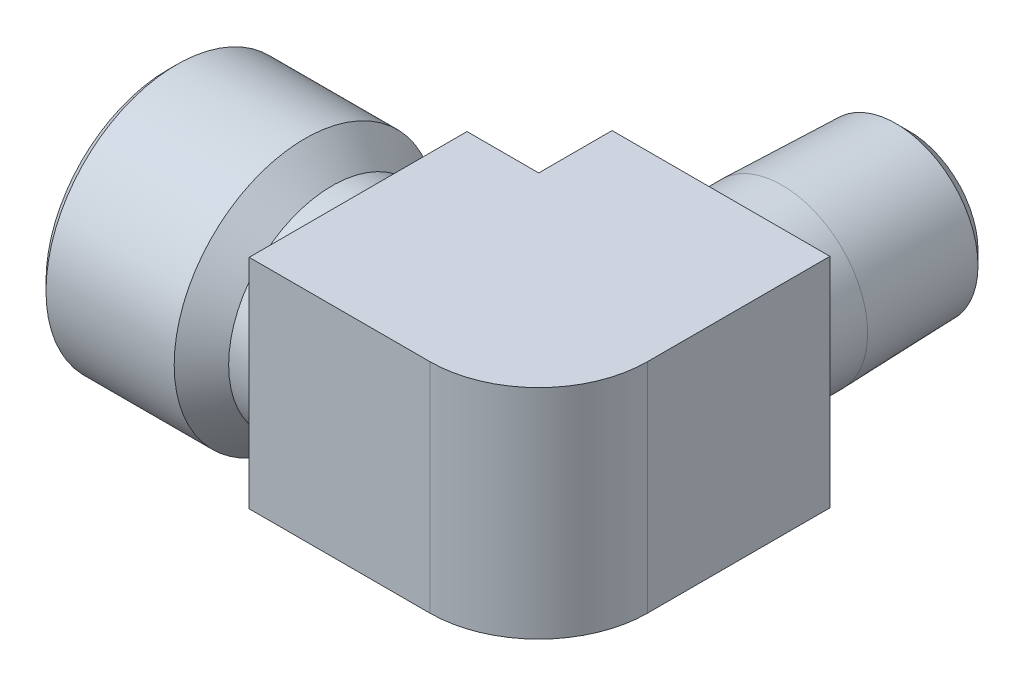
ISO-10303-21;
HEADER;
FILE_DESCRIPTION(('STEP AP214'),'2;1');
FILE_NAME('part.step','',(''),(''),'','','');
FILE_SCHEMA(('AUTOMOTIVE_DESIGN { 1 0 10303 214 1 1 1 1 }'));
ENDSEC;
DATA;
#1=APPLICATION_CONTEXT('core data for automotive mechanical design processes');
#2=APPLICATION_PROTOCOL_DEFINITION('international standard','automotive_design',2000,#1);
#3=PRODUCT_CONTEXT('',#1,'mechanical');
#4=PRODUCT('Part','Part','',(#3));
#5=PRODUCT_RELATED_PRODUCT_CATEGORY('part','',(#4));
#6=PRODUCT_DEFINITION_FORMATION('','',#4);
#7=PRODUCT_DEFINITION_CONTEXT('part definition',#1,'design');
#8=PRODUCT_DEFINITION('design','',#6,#7);
#9=PRODUCT_DEFINITION_SHAPE('','',#8);
#10=(LENGTH_UNIT() NAMED_UNIT(*) SI_UNIT(.MILLI.,.METRE.));
#11=(NAMED_UNIT(*) PLANE_ANGLE_UNIT() SI_UNIT($,.RADIAN.));
#12=(NAMED_UNIT(*) SI_UNIT($,.STERADIAN.) SOLID_ANGLE_UNIT());
#13=UNCERTAINTY_MEASURE_WITH_UNIT(LENGTH_MEASURE(1.E-05),#10,'distance_accuracy_value','');
#14=(GEOMETRIC_REPRESENTATION_CONTEXT(3) GLOBAL_UNCERTAINTY_ASSIGNED_CONTEXT((#13)) GLOBAL_UNIT_ASSIGNED_CONTEXT((#10,
#11,#12)) REPRESENTATION_CONTEXT('',''));
#15=CARTESIAN_POINT('',(0.,0.,0.));
#16=DIRECTION('',(0.,0.,1.));
#17=DIRECTION('',(1.,0.,0.));
#18=AXIS2_PLACEMENT_3D('',#15,#16,#17);
#19=CARTESIAN_POINT('',(1.12877599997319,0.,0.));
#20=DIRECTION('',(-1.,0.,0.));
#21=DIRECTION('',(0.,0.,1.));
#22=AXIS2_PLACEMENT_3D('',#19,#20,#21);
#23=CONICAL_SURFACE('',#22,5.67931299999991,0.0256563400042754);
#24=CARTESIAN_POINT('',(10.0203,0.,0.));
#25=DIRECTION('',(1.,0.,0.));
#26=DIRECTION('',(0.,0.,-1.));
#27=AXIS2_PLACEMENT_3D('',#24,#25,#26);
#28=CIRCLE('',#27,5.45113896988587);
#29=CARTESIAN_POINT('',(10.0203,0.,-5.45113896988587));
#30=VERTEX_POINT('',#29);
#31=EDGE_CURVE('E104',#30,#30,#28,.T.);
#32=ORIENTED_EDGE('',*,*,#31,.T.);
#33=EDGE_LOOP('',(#32));
#34=FACE_BOUND('',#33,.T.);
#35=CARTESIAN_POINT('',(1.12877600003003,0.,0.));
#36=DIRECTION('',(-1.,0.,0.));
#37=DIRECTION('',(0.,0.,-1.));
#38=AXIS2_PLACEMENT_3D('',#35,#36,#37);
#39=CIRCLE('',#38,5.67931299997326);
#40=CARTESIAN_POINT('',(1.12877600003003,0.,-5.67931299997326));
#41=VERTEX_POINT('',#40);
#42=EDGE_CURVE('E257',#41,#41,#39,.T.);
#43=ORIENTED_EDGE('',*,*,#42,.T.);
#44=EDGE_LOOP('',(#43));
#45=FACE_BOUND('',#44,.T.);
#46=ADVANCED_FACE('F16',(#34,#45),#23,.F.);
#47=CARTESIAN_POINT('',(-5.68438357222604E-11,0.,0.));
#48=DIRECTION('',(-1.,0.,0.));
#49=DIRECTION('',(0.,0.,1.));
#50=AXIS2_PLACEMENT_3D('',#47,#48,#49);
#51=CONICAL_SURFACE('',#50,6.80808900006014,0.785398163397448);
#52=ORIENTED_EDGE('',*,*,#42,.F.);
#53=EDGE_LOOP('',(#52));
#54=FACE_BOUND('',#53,.T.);
#55=CARTESIAN_POINT('',(5.68430019993557E-11,0.,0.));
#56=DIRECTION('',(-1.,0.,0.));
#57=DIRECTION('',(0.,0.,1.));
#58=AXIS2_PLACEMENT_3D('',#55,#56,#57);
#59=CIRCLE('',#58,6.80808899994645);
#60=CARTESIAN_POINT('',(5.68425851379033E-11,0.,6.80808899994645));
#61=VERTEX_POINT('',#60);
#62=EDGE_CURVE('E103',#61,#61,#59,.F.);
#63=ORIENTED_EDGE('',*,*,#62,.F.);
#64=EDGE_LOOP('',(#63));
#65=FACE_BOUND('',#64,.T.);
#66=ADVANCED_FACE('F149',(#54,#65),#51,.F.);
#67=CARTESIAN_POINT('',(13.9114305150571,0.,0.));
#68=DIRECTION('',(1.,0.,0.));
#69=DIRECTION('',(0.,0.,-1.));
#70=AXIS2_PLACEMENT_3D('',#67,#68,#69);
#71=CYLINDRICAL_SURFACE('',#70,5.45113896988587);
#72=CARTESIAN_POINT('',(27.8228610301141,0.,0.));
#73=DIRECTION('',(1.,0.,0.));
#74=DIRECTION('',(0.,1.,0.));
#75=AXIS2_PLACEMENT_3D('',#72,#73,#74);
#76=CIRCLE('',#75,5.45113896988587);
#77=CARTESIAN_POINT('',(27.8228610301141,3.00891746061934,-4.54547376894735));
#78=VERTEX_POINT('',#77);
#79=CARTESIAN_POINT('',(27.8228610301141,-3.00891746061934,-4.54547376894734));
#80=VERTEX_POINT('',#79);
#81=EDGE_CURVE('E97',#78,#80,#76,.T.);
#82=ORIENTED_EDGE('',*,*,#81,.T.);
#83=CARTESIAN_POINT('',(27.8228610301141,-3.00891746061933,-4.54547376894736));
#84=CARTESIAN_POINT('',(27.7349198119855,-2.95351373307247,-4.58215871475006));
#85=CARTESIAN_POINT('',(27.6496891621434,-2.89446070962744,-4.61978348688427));
#86=CARTESIAN_POINT('',(27.4849148246585,-2.76933098411947,-4.69585540376988));
#87=CARTESIAN_POINT('',(27.4053720609343,-2.70325314528766,-4.73430268081407));
#88=CARTESIAN_POINT('',(27.2516968172436,-2.56384869759814,-4.81123569674424));
#89=CARTESIAN_POINT('',(27.1776091343437,-2.49047168107598,-4.84971958211876));
#90=CARTESIAN_POINT('',(27.0358754590781,-2.33714437953146,-4.92544217869873));
#91=CARTESIAN_POINT('',(26.9682292374351,-2.25719432865868,-4.96268093419273));
#92=CARTESIAN_POINT('',(26.8396584331133,-2.09078171424466,-5.03505724292087));
#93=CARTESIAN_POINT('',(26.7787519989994,-2.00430257343263,-5.07018901152304));
#94=CARTESIAN_POINT('',(26.6644196982228,-1.82539100879123,-5.13731368710424));
#95=CARTESIAN_POINT('',(26.6109927497559,-1.73295944872636,-5.16930704780981));
#96=CARTESIAN_POINT('',(26.5123863869596,-1.54291631488662,-5.22916891893917));
#97=CARTESIAN_POINT('',(26.4671805025088,-1.44532272084188,-5.25705061120318));
#98=CARTESIAN_POINT('',(26.3854640927888,-1.24539755583957,-5.30797133188177));
#99=CARTESIAN_POINT('',(26.3489511017814,-1.14306733828496,-5.33101173330969));
#100=CARTESIAN_POINT('',(26.266364561403,-0.872600549017273,-5.38349331336362));
#101=CARTESIAN_POINT('',(26.2274145978365,-0.701348221875679,-5.40865701457062));
#102=CARTESIAN_POINT('',(26.1752328710422,-0.353401118303035,-5.44247970507157));
#103=CARTESIAN_POINT('',(26.1619972397318,-0.176707164492384,-5.45114117671236));
#104=CARTESIAN_POINT('',(26.1620028033068,0.179462416864416,-5.45113672865011));
#105=CARTESIAN_POINT('',(26.1756600478007,0.358938459589324,-5.44219853115471));
#106=CARTESIAN_POINT('',(26.2294556976039,0.712140724672644,-5.40733849513127));
#107=CARTESIAN_POINT('',(26.2696005254539,0.885865541778837,-5.38141253752986));
#108=CARTESIAN_POINT('',(26.3739389012261,1.22198259274928,-5.31515891418252));
#109=CARTESIAN_POINT('',(26.4380182150287,1.38442437855224,-5.27489970003781));
#110=CARTESIAN_POINT('',(26.5875910879881,1.69574366322573,-5.18321815973958));
#111=CARTESIAN_POINT('',(26.6731002355157,1.84461117999737,-5.13178771111436));
#112=CARTESIAN_POINT('',(26.8709288785881,2.13853238805546,-5.01682775784338));
#113=CARTESIAN_POINT('',(26.9848989918246,2.28221089775577,-4.95264429804545));
#114=CARTESIAN_POINT('',(27.232319997251,2.54944190531762,-4.82052282182768));
#115=CARTESIAN_POINT('',(27.3657522408123,2.67301343255857,-4.75258843784371));
#116=CARTESIAN_POINT('',(27.5582802035208,2.82575266271654,-4.6617819458398));
#117=CARTESIAN_POINT('',(27.6097355650883,2.86435127071612,-4.63814028039786));
#118=CARTESIAN_POINT('',(27.7147284972524,2.93873551672546,-4.59136935109783));
#119=CARTESIAN_POINT('',(27.7682627200606,2.97452541819214,-4.56823935045447));
#120=CARTESIAN_POINT('',(27.8228610301141,3.00891746061933,-4.54547376894736));
#121=B_SPLINE_CURVE_WITH_KNOTS('',3,(#83,#84,#85,#86,#87,#88,#89,#90,#91,#92,#93,#94,#95,#96,
#97,#98,#99,#100,#101,#102,#103,#104,#105,#106,#107,#108,#109,#110,#111,#112,#113,#114,#115,
#116,#117,#118,#119,#120),.UNSPECIFIED.,.F.,.F.,(4,2,2,2,2,2,2,2,2,2,2,2,2,2,2,2,2,2,4),(0.,
0.330549125994344,0.661151823726943,0.994221302050018,1.327278920658,1.66121261031979,
1.99509795108102,2.3278884439718,2.66058442811145,3.19010741070196,3.71955073354044,
4.25724923932693,4.79507817076035,5.33037229704145,5.86605693997033,6.44682100731037,
7.02703219800775,7.23255514780071,7.43775983564309),.UNSPECIFIED.);
#122=EDGE_CURVE('E95',#80,#78,#121,.T.);
#123=ORIENTED_EDGE('',*,*,#122,.T.);
#124=EDGE_LOOP('',(#82,#123));
#125=FACE_BOUND('',#124,.T.);
#126=ORIENTED_EDGE('',*,*,#31,.F.);
#127=EDGE_LOOP('',(#126));
#128=FACE_BOUND('',#127,.T.);
#129=ADVANCED_FACE('F98',(#125,#128),#71,.F.);
#130=CARTESIAN_POINT('',(27.8228610301141,0.,0.));
#131=DIRECTION('',(1.,0.,0.));
#132=DIRECTION('',(0.,1.,0.));
#133=AXIS2_PLACEMENT_3D('',#130,#131,#132);
#134=SPHERICAL_SURFACE('',#133,5.45113896988587);
#135=ORIENTED_EDGE('',*,*,#81,.F.);
#136=CARTESIAN_POINT('',(27.8228610301141,3.00891746061935,-4.54547376894735));
#137=CARTESIAN_POINT('',(27.8634152820483,3.03446072312548,-4.52856564561903));
#138=CARTESIAN_POINT('',(27.904407216055,3.05912673323248,-4.51138493574606));
#139=CARTESIAN_POINT('',(27.9877963853062,3.10704103307572,-4.47623358830602));
#140=CARTESIAN_POINT('',(28.0302054393705,3.13026294626452,-4.45825502419309));
#141=CARTESIAN_POINT('',(28.116402665264,3.17520691910712,-4.4214875309477));
#142=CARTESIAN_POINT('',(28.1602019984082,3.19690089034557,-4.40269044697431));
#143=CARTESIAN_POINT('',(28.2491490505397,3.23870449763516,-4.36426563763949));
#144=CARTESIAN_POINT('',(28.2943071467146,3.25878436371748,-4.34462955324843));
#145=CARTESIAN_POINT('',(28.3859356621001,3.29727194419186,-4.30450667478441));
#146=CARTESIAN_POINT('',(28.4324155425656,3.3156482221911,-4.28401134108553));
#147=CARTESIAN_POINT('',(28.5266459515633,3.35063814200538,-4.24215020273342));
#148=CARTESIAN_POINT('',(28.5744048956,3.36721870616647,-4.2207757018417));
#149=CARTESIAN_POINT('',(28.6711457242138,3.39852430592184,-4.17713684546604));
#150=CARTESIAN_POINT('',(28.720134848113,3.41321465149363,-4.15486366115773));
#151=CARTESIAN_POINT('',(28.819281914952,3.44064493259195,-4.10940849679077));
#152=CARTESIAN_POINT('',(28.8694457902659,3.45334860102268,-4.08621757937684));
#153=CARTESIAN_POINT('',(28.9708814361423,3.47670908077285,-4.03890850379508));
#154=CARTESIAN_POINT('',(29.0221577006785,3.48732808990097,-4.01478132370317));
#155=CARTESIAN_POINT('',(29.1257500195079,3.50642170983947,-3.96558181887924));
#156=CARTESIAN_POINT('',(29.1780689972524,3.51485703305327,-3.94050041142332));
#157=CARTESIAN_POINT('',(29.2836710840083,3.52948515426948,-3.88937512586166));
#158=CARTESIAN_POINT('',(29.3369554132805,3.53563723754148,-3.86332212769686));
#159=CARTESIAN_POINT('',(29.4444046324901,3.54560071557506,-3.81023694240232));
#160=CARTESIAN_POINT('',(29.4985689065948,3.54937003625026,-3.78319562092964));
#161=CARTESIAN_POINT('',(29.607686188899,3.55447037913219,-3.72811770255836));
#162=CARTESIAN_POINT('',(29.6626366125165,3.55575804606544,-3.70007197956478));
#163=CARTESIAN_POINT('',(29.7732257863963,3.55579865563879,-3.64296982357742));
#164=CARTESIAN_POINT('',(29.8288598515762,3.55450705121141,-3.6139042946511));
#165=CARTESIAN_POINT('',(29.9407070181308,3.5492945483829,-3.55474776167923));
#166=CARTESIAN_POINT('',(29.9969132038995,3.54532801248642,-3.52464771307454));
#167=CARTESIAN_POINT('',(30.1097861631074,3.53467364611817,-3.46340806226879));
#168=CARTESIAN_POINT('',(30.1664436631033,3.527939201694,-3.43225948732436));
#169=CARTESIAN_POINT('',(30.2800914002309,3.51166034126679,-3.36890941028857));
#170=CARTESIAN_POINT('',(30.337069882595,3.50206846193862,-3.33669902689106));
#171=CARTESIAN_POINT('',(30.4512221251393,3.47999016998805,-3.27121268850111));
#172=CARTESIAN_POINT('',(30.50838153083,3.46745558514251,-3.237927962462));
#173=CARTESIAN_POINT('',(30.6227483822308,3.43941227807928,-3.17028104663014));
#174=CARTESIAN_POINT('',(30.6799387616927,3.42385482895255,-3.13591021396514));
#175=CARTESIAN_POINT('',(30.7942104363221,3.38969198300181,-3.06608000606884));
#176=CARTESIAN_POINT('',(30.851271849494,3.37103747168905,-3.0306121337246));
#177=CARTESIAN_POINT('',(30.9651184656267,3.33061352542916,-2.95857754452099));
#178=CARTESIAN_POINT('',(31.0218808753143,3.30879477113224,-2.92200249173053));
#179=CARTESIAN_POINT('',(31.1349525246197,3.26198262540894,-2.84774441583464));
#180=CARTESIAN_POINT('',(31.1912359780833,3.23693989611648,-2.81005323888544));
#181=CARTESIAN_POINT('',(31.3031622886829,3.18363028366685,-2.73355377191759));
#182=CARTESIAN_POINT('',(31.3587762852237,3.15531427730635,-2.6947375081705));
#183=CARTESIAN_POINT('',(31.4691685342691,3.09541226614599,-2.61598370971724));
#184=CARTESIAN_POINT('',(31.5239148301894,3.06377746386228,-2.57603846616813));
#185=CARTESIAN_POINT('',(31.6202410477983,3.00466226459321,-2.50406342374387));
#186=CARTESIAN_POINT('',(31.6621919389632,2.97768554872489,-2.47211458151596));
#187=CARTESIAN_POINT('',(31.7450438546768,2.92192949464733,-2.40775337901469));
#188=CARTESIAN_POINT('',(31.7859368357892,2.89314009057253,-2.37533937648732));
#189=CARTESIAN_POINT('',(31.8665989786538,2.83377987973927,-2.31006194830496));
#190=CARTESIAN_POINT('',(31.9063595310734,2.80319907416766,-2.27719698025179));
#191=CARTESIAN_POINT('',(31.9846827496433,2.74028463221144,-2.21102619583303));
#192=CARTESIAN_POINT('',(32.0232362453755,2.70794113005324,-2.17771890583919));
#193=CARTESIAN_POINT('',(32.0990706766404,2.64153292337876,-2.11067250096609));
#194=CARTESIAN_POINT('',(32.1363418849316,2.60745852521502,-2.07693198666278));
#195=CARTESIAN_POINT('',(32.2095367830106,2.53762399602361,-2.00902754338441));
#196=CARTESIAN_POINT('',(32.2454501974422,2.50185438693087,-1.97486228730108));
#197=CARTESIAN_POINT('',(32.3158542524418,2.42867029996247,-1.90611457431149));
#198=CARTESIAN_POINT('',(32.3503340803849,2.39124661223811,-1.87153084977683));
#199=CARTESIAN_POINT('',(32.4177959625179,2.31479386804946,-1.80195795989633));
#200=CARTESIAN_POINT('',(32.4507666832759,2.27575587699678,-1.7669676237266));
#201=CARTESIAN_POINT('',(32.5141606417924,2.19734294545845,-1.69763431461479));
#202=CARTESIAN_POINT('',(32.5446257761427,2.15799800823414,-1.66329569466419));
#203=CARTESIAN_POINT('',(32.6039104850176,2.07804464682662,-1.59433061908926));
#204=CARTESIAN_POINT('',(32.6327245090319,2.03743259736475,-1.55970359503358));
#205=CARTESIAN_POINT('',(32.6886567450369,1.95499746029362,-1.49017930661313));
#206=CARTESIAN_POINT('',(32.7157691828292,1.91317088669288,-1.45528153072876));
#207=CARTESIAN_POINT('',(32.7682491269511,1.82836699682322,-1.38522643224935));
#208=CARTESIAN_POINT('',(32.793610647948,1.78538636966804,-1.35006863426716));
#209=CARTESIAN_POINT('',(32.8425410538476,1.6983358907738,-1.27950530564995));
#210=CARTESIAN_POINT('',(32.8661037563954,1.65426291657118,-1.24409934044272));
#211=CARTESIAN_POINT('',(32.9113902847869,1.56509219116676,-1.17305053774288));
#212=CARTESIAN_POINT('',(32.9331077459542,1.51999152353626,-1.13740730409308));
#213=CARTESIAN_POINT('',(32.974659127638,1.42883224670311,-1.06589452241999));
#214=CARTESIAN_POINT('',(32.9944865164293,1.38277094160944,-1.03002461611925));
#215=CARTESIAN_POINT('',(33.0322147622149,1.28975967107908,-0.958068668873447));
#216=CARTESIAN_POINT('',(33.0501089360031,1.24280724363517,-0.921982306507774));
#217=CARTESIAN_POINT('',(33.0839295342481,1.14808534588886,-0.849603375275531));
#218=CARTESIAN_POINT('',(33.0998491396779,1.10031365910678,-0.813310521049314));
#219=CARTESIAN_POINT('',(33.1296812573282,1.0040271256376,-0.740528361116257));
#220=CARTESIAN_POINT('',(33.1435868302404,0.955510318114494,-0.704038805419632));
#221=CARTESIAN_POINT('',(33.1693535113052,0.85780960391135,-0.630872921674525));
#222=CARTESIAN_POINT('',(33.1812075750843,0.808624000648123,-0.594196378517545));
#223=CARTESIAN_POINT('',(33.2028359427466,0.70966384310137,-0.520666221546165));
#224=CARTESIAN_POINT('',(33.2126031119205,0.659887863687612,-0.483812427253336));
#225=CARTESIAN_POINT('',(33.2300245532683,0.559827094305827,-0.409937593199552));
#226=CARTESIAN_POINT('',(33.2376716144005,0.509541156570013,-0.372916407611598));
#227=CARTESIAN_POINT('',(33.2508220237214,0.408542495844816,-0.298716853902561));
#228=CARTESIAN_POINT('',(33.2563180979465,0.357828907184674,-0.261538374968183));
#229=CARTESIAN_POINT('',(33.2651378921618,0.256058766860501,-0.187034615923172));
#230=CARTESIAN_POINT('',(33.268454286929,0.205001635425587,-0.149709260624513));
#231=CARTESIAN_POINT('',(33.2728892655122,0.102629838363063,-0.0749226711182586));
#232=CARTESIAN_POINT('',(33.2740004865382,0.0513148815860485,-0.0374613987022869));
#233=CARTESIAN_POINT('',(33.274,0.,0.));
#234=B_SPLINE_CURVE_WITH_KNOTS('',3,(#136,#137,#138,#139,#140,#141,#142,#143,#144,#145,#146,
#147,#148,#149,#150,#151,#152,#153,#154,#155,#156,#157,#158,#159,#160,#161,#162,#163,#164,#165,
#166,#167,#168,#169,#170,#171,#172,#173,#174,#175,#176,#177,#178,#179,#180,#181,#182,#183,#184,
#185,#186,#187,#188,#189,#190,#191,#192,#193,#194,#195,#196,#197,#198,#199,#200,#201,#202,#203,
#204,#205,#206,#207,#208,#209,#210,#211,#212,#213,#214,#215,#216,#217,#218,#219,#220,#221,#222,
#223,#224,#225,#226,#227,#228,#229,#230,#231,#232,#233),.UNSPECIFIED.,.F.,.F.,(4,2,2,2,2,2,2,2,
2,2,2,2,2,2,2,2,2,2,2,2,2,2,2,2,2,2,2,2,2,2,2,2,2,2,2,2,2,2,2,2,2,2,2,2,2,2,2,2,4),(0.,
0.152457877419052,0.307171524009202,0.464231587323529,0.623726137073317,0.785740953660582,
0.950359796563216,1.11766464812835,1.28773592893778,1.46065268151896,1.6364927197882,
1.81533274223378,1.99724840747757,2.18231437149765,2.37060428645202,2.5621907617136,
2.75714528840656,2.95553812941877,3.15743817754796,3.36291278511068,3.57202756899414,
3.78484619574879,4.0014301518921,4.22183850510849,4.44612766247208,4.62378586827036,
4.80253667988524,4.98240338060049,5.16340807041966,5.345571569979,5.52891333936689,
5.71345141276556,5.89920234966938,6.08054332578822,6.26246190811597,6.44496771159575,
6.62806931170748,6.81177425664935,6.99608909172127,7.1810193955314,7.36656982753304,
7.55274418628973,7.73954547776237,7.92697599281334,8.11503739302982,8.3037308038816,
8.49305691414854,8.6830160804791,8.87360843587521),.UNSPECIFIED.);
#235=CARTESIAN_POINT('',(33.274,0.,0.));
#236=VERTEX_POINT('',#235);
#237=EDGE_CURVE('E111',#78,#236,#234,.T.);
#238=ORIENTED_EDGE('',*,*,#237,.T.);
#239=CARTESIAN_POINT('',(33.274,0.,0.));
#240=CARTESIAN_POINT('',(33.2740004865993,-0.0513165455514477,-0.0374626136061651));
#241=CARTESIAN_POINT('',(33.2728891934733,-0.102633166430921,-0.0749251007074303));
#242=CARTESIAN_POINT('',(33.2684539366609,-0.205008062971294,-0.149713954492628));
#243=CARTESIAN_POINT('',(33.2651373455688,-0.256066630173907,-0.187040359443855));
#244=CARTESIAN_POINT('',(33.2563170544508,-0.357839408504924,-0.261546050345987));
#245=CARTESIAN_POINT('',(33.2508206893723,-0.408554200182751,-0.298725411599191));
#246=CARTESIAN_POINT('',(33.2376696239085,-0.509555030413749,-0.372926561218364));
#247=CARTESIAN_POINT('',(33.2300222071162,-0.559841935797349,-0.409948460562538));
#248=CARTESIAN_POINT('',(33.2126000096363,-0.659904402861554,-0.483824552975474));
#249=CARTESIAN_POINT('',(33.202832449514,-0.709681113844405,-0.52067889208378));
#250=CARTESIAN_POINT('',(33.1812032844867,-0.808642497677702,-0.594209969996217));
#251=CARTESIAN_POINT('',(33.1693488236974,-0.857828597561085,-0.630886889536225));
#252=CARTESIAN_POINT('',(33.1435813620888,-0.955530070727694,-0.704053358679471));
#253=CARTESIAN_POINT('',(33.1296754149217,-1.00404714285807,-0.740543123691482));
#254=CARTESIAN_POINT('',(33.0998425906773,-1.10033397560016,-0.81332553705865));
#255=CARTESIAN_POINT('',(33.083922662049,-1.14810569966573,-0.849618435745167));
#256=CARTESIAN_POINT('',(33.0501014871535,-1.24282744807949,-0.921997293706581));
#257=CARTESIAN_POINT('',(33.0322070689058,-1.28977969187137,-0.958083538723062));
#258=CARTESIAN_POINT('',(32.9944784310708,-1.38279037887479,-1.03003909291876));
#259=CARTESIAN_POINT('',(32.9746509035248,-1.4288512873957,-1.06590872394052));
#260=CARTESIAN_POINT('',(32.933099367521,-1.5200095641343,-1.13742080133399));
#261=CARTESIAN_POINT('',(32.9113818994571,-1.56510963187483,-1.17306360644532));
#262=CARTESIAN_POINT('',(32.8660955058968,-1.65427896122542,-1.24411140389679));
#263=CARTESIAN_POINT('',(32.8425329535702,-1.69835114321712,-1.27951679289708));
#264=CARTESIAN_POINT('',(32.7936030211753,-1.78539985385786,-1.3500788268906));
#265=CARTESIAN_POINT('',(32.7682418317718,-1.82837950923476,-1.38523590700188));
#266=CARTESIAN_POINT('',(32.7157627473638,-1.91318128417476,-1.45528943577745));
#267=CARTESIAN_POINT('',(32.6886508458104,-1.95500671919297,-1.49018636041678));
#268=CARTESIAN_POINT('',(32.6327199008436,-2.03743942630177,-1.5597088159298));
#269=CARTESIAN_POINT('',(32.6039066395487,-2.07805018923808,-1.59433485896552));
#270=CARTESIAN_POINT('',(32.5446236966364,-2.15800082635045,-1.66329786693119));
#271=CARTESIAN_POINT('',(32.5141595732407,-2.19734433096882,-1.69763540095591));
#272=CARTESIAN_POINT('',(32.4507631889063,-2.27576013387085,-1.76697152981886));
#273=CARTESIAN_POINT('',(32.4177887787161,-2.3148022482463,-1.80196574509762));
#274=CARTESIAN_POINT('',(32.3503201938723,-2.39126180029777,-1.87154519581766));
#275=CARTESIAN_POINT('',(32.3158374076798,-2.42868821561544,-1.90613160824477));
#276=CARTESIAN_POINT('',(32.245428288354,-2.50187640812819,-1.97488354321417));
#277=CARTESIAN_POINT('',(32.2095128207355,-2.53764744011251,-2.00905033987033));
#278=CARTESIAN_POINT('',(32.1363148345889,-2.607483579411,-2.07695674014298));
#279=CARTESIAN_POINT('',(32.0990426421364,-2.64155821157825,-2.11069767762147));
#280=CARTESIAN_POINT('',(32.0232074171395,-2.70796576785421,-2.17774384602378));
#281=CARTESIAN_POINT('',(31.9846541603671,-2.74030843413097,-2.21105048341258));
#282=CARTESIAN_POINT('',(31.9063327407338,-2.80322020839548,-2.27721892856079));
#283=CARTESIAN_POINT('',(31.8665737946105,-2.83379923232261,-2.3100822172771));
#284=CARTESIAN_POINT('',(31.7859163202052,-2.89315502001942,-2.37535530001746));
#285=CARTESIAN_POINT('',(31.7450264453603,-2.92194183429046,-2.40776664407999));
#286=CARTESIAN_POINT('',(31.662182326731,-2.97769195759841,-2.47212162827945));
#287=CARTESIAN_POINT('',(31.6202361682149,-3.00466538569087,-2.50406691860142));
#288=CARTESIAN_POINT('',(31.5239143447077,-3.06377760206907,-2.57603901979497));
#289=CARTESIAN_POINT('',(31.4691675513014,-3.0954124739334,-2.61598485417867));
#290=CARTESIAN_POINT('',(31.3587743136079,-3.15531458447537,-2.69473975339608));
#291=CARTESIAN_POINT('',(31.3031598275603,-3.18363062261863,-2.73355652815368));
#292=CARTESIAN_POINT('',(31.1912325556341,-3.23694023583048,-2.81005696530439));
#293=CARTESIAN_POINT('',(31.1349486317987,-3.26198293661348,-2.84774860204069));
#294=CARTESIAN_POINT('',(31.0218760655194,-3.30879497873869,-2.92200753551339));
#295=CARTESIAN_POINT('',(30.9651132105538,-3.33061366032214,-2.95858298691175));
#296=CARTESIAN_POINT('',(30.8512657342392,-3.37103742064104,-3.03061831236516));
#297=CARTESIAN_POINT('',(30.7942039073492,-3.38969182114043,-3.0660865231833));
#298=CARTESIAN_POINT('',(30.6799314412867,-3.42385441366112,-3.13591734608803));
#299=CARTESIAN_POINT('',(30.6227406851671,-3.43941172258077,-3.17028845616887));
#300=CARTESIAN_POINT('',(30.5083731215225,-3.46745472535397,-3.23793586532013));
#301=CARTESIAN_POINT('',(30.4512133811772,-3.47998914853616,-3.27122080817056));
#302=CARTESIAN_POINT('',(30.3370605148243,-3.50206710124329,-3.33670751956701));
#303=CARTESIAN_POINT('',(30.280081744115,-3.51165880542097,-3.36891806008694));
#304=CARTESIAN_POINT('',(30.1664334796428,-3.52793730733536,-3.43226839231397));
#305=CARTESIAN_POINT('',(30.109775741335,-3.53467157084087,-3.46341706626348));
#306=CARTESIAN_POINT('',(29.9969023581341,-3.5453255746187,-3.52465685815489));
#307=CARTESIAN_POINT('',(29.9406959872514,-3.54929193130418,-3.55475694977666));
#308=CARTESIAN_POINT('',(29.8288485058597,-3.55450408210834,-3.61391351452931));
#309=CARTESIAN_POINT('',(29.7732143114028,-3.55579551620315,-3.64297903314772));
#310=CARTESIAN_POINT('',(29.6626249366299,-3.55575457916823,-3.7000811174331));
#311=CARTESIAN_POINT('',(29.6076744417203,-3.55446675760914,-3.72812677994525));
#312=CARTESIAN_POINT('',(29.4985570763087,-3.54936612510337,-3.78320452988933));
#313=CARTESIAN_POINT('',(29.4443927905889,-3.54559667195735,-3.81024574430611));
#314=CARTESIAN_POINT('',(29.336943609025,-3.53563295462233,-3.86333067205724));
#315=CARTESIAN_POINT('',(29.2836593290875,-3.52948076707167,-3.88938352059539));
#316=CARTESIAN_POINT('',(29.178057402897,-3.51485246851304,-3.9405084678721));
#317=CARTESIAN_POINT('',(29.1257385363275,-3.50641707481193,-3.965589687496));
#318=CARTESIAN_POINT('',(29.0221465024228,-3.48732335022992,-4.01478878234775));
#319=CARTESIAN_POINT('',(28.9708704114479,-3.47670430954512,-4.03891574108632));
#320=CARTESIAN_POINT('',(28.8694351756417,-3.45334380765418,-4.08622434465661));
#321=CARTESIAN_POINT('',(28.8192715365127,-3.44064015125924,-4.10941501215561));
#322=CARTESIAN_POINT('',(28.7201250050964,-3.41320993935991,-4.15486965262807));
#323=CARTESIAN_POINT('',(28.6711361799718,-3.39851965358753,-4.17714256365287));
#324=CARTESIAN_POINT('',(28.5743960118314,-3.36721422221894,-4.22078085483125));
#325=CARTESIAN_POINT('',(28.5266374288887,-3.35063376929238,-4.24215506445527));
#326=CARTESIAN_POINT('',(28.4324078046768,-3.31564412389701,-4.28401560722885));
#327=CARTESIAN_POINT('',(28.3859283471549,-3.29726801173341,-4.30451063721092));
#328=CARTESIAN_POINT('',(28.2943007397549,-3.2587808175456,-4.34463290089646));
#329=CARTESIAN_POINT('',(28.2491431277296,-3.2387011745613,-4.36426867476644));
#330=CARTESIAN_POINT('',(28.1601971053838,-3.19689807024645,-4.40269286148753));
#331=CARTESIAN_POINT('',(28.1163983168394,-3.17520438151792,-4.42148963385474));
#332=CARTESIAN_POINT('',(28.0302022408262,-3.13026103217515,-4.45825650811414));
#333=CARTESIAN_POINT('',(27.9877937908654,-3.10703946258444,-4.47623476527986));
#334=CARTESIAN_POINT('',(27.9044058899365,-3.05912590954106,-4.51138550888205));
#335=CARTESIAN_POINT('',(27.8634146188293,-3.03446030520623,-4.52856592224338));
#336=CARTESIAN_POINT('',(27.8228610301141,-3.00891746061935,-4.54547376894735));
#337=B_SPLINE_CURVE_WITH_KNOTS('',3,(#239,#240,#241,#242,#243,#244,#245,#246,#247,#248,#249,
#250,#251,#252,#253,#254,#255,#256,#257,#258,#259,#260,#261,#262,#263,#264,#265,#266,#267,#268,
#269,#270,#271,#272,#273,#274,#275,#276,#277,#278,#279,#280,#281,#282,#283,#284,#285,#286,#287,
#288,#289,#290,#291,#292,#293,#294,#295,#296,#297,#298,#299,#300,#301,#302,#303,#304,#305,#306,
#307,#308,#309,#310,#311,#312,#313,#314,#315,#316,#317,#318,#319,#320,#321,#322,#323,#324,#325,
#326,#327,#328,#329,#330,#331,#332,#333,#334,#335,#336),.UNSPECIFIED.,.F.,.F.,(4,2,2,2,2,2,2,2,
2,2,2,2,2,2,2,2,2,2,2,2,2,2,2,2,2,2,2,2,2,2,2,2,2,2,2,2,2,2,2,2,2,2,2,2,2,2,2,2,4),(0.,
0.190598535255206,0.380563057469795,0.569893699648614,0.758590818450695,0.946655102677754,
1.13408767783625,1.32089020556821,1.50706497681238,1.69261499763098,1.87754406671745,
2.06185684368761,2.24555890734932,2.42865680324483,2.6111580798636,2.79307131303343,
2.97440611811085,3.16017730664736,3.34472985535097,3.52808031945393,3.71024672839999,
3.89124853717779,4.07110656111113,4.24984289486118,4.42748081655662,4.65177209732895,
4.87218240751486,5.08876815187844,5.30158839542857,5.51070462167167,5.71618049384878,
5.91808162528326,6.11647536452311,6.31143060044782,6.50301759193703,6.69130782608006,
6.87637390825493,7.05828948673376,7.23712921378859,7.41296874458725,7.58588477448887,
7.75595511467866,7.92325880542412,8.08787626559083,8.24988947642521,8.40938219699065,
8.56644020802991,8.72115158041751,8.87360696375694),.UNSPECIFIED.);
#338=EDGE_CURVE('E109',#236,#80,#337,.T.);
#339=ORIENTED_EDGE('',*,*,#338,.T.);
#340=EDGE_LOOP('',(#135,#238,#339));
#341=FACE_BOUND('',#340,.T.);
#342=ADVANCED_FACE('F114',(#341),#134,.F.);
#343=CARTESIAN_POINT('',(0.,0.,-5.23875));
#344=DIRECTION('',(-1.,0.,0.));
#345=DIRECTION('',(0.,0.,1.));
#346=AXIS2_PLACEMENT_3D('',#343,#344,#345);
#347=PLANE('',#346);
#348=ORIENTED_EDGE('',*,*,#62,.T.);
#349=EDGE_LOOP('',(#348));
#350=FACE_BOUND('',#349,.T.);
#351=CARTESIAN_POINT('',(0.,0.,0.));
#352=DIRECTION('',(1.,0.,0.));
#353=DIRECTION('',(0.,0.,-1.));
#354=AXIS2_PLACEMENT_3D('',#351,#352,#353);
#355=CIRCLE('',#354,9.779);
#356=CARTESIAN_POINT('',(0.,0.,-9.779));
#357=VERTEX_POINT('',#356);
#358=EDGE_CURVE('E237',#357,#357,#355,.T.);
#359=ORIENTED_EDGE('',*,*,#358,.F.);
#360=EDGE_LOOP('',(#359));
#361=FACE_BOUND('',#360,.T.);
#362=ADVANCED_FACE('F131',(#350,#361),#347,.T.);
#363=CARTESIAN_POINT('',(29.718,0.,-22.16658));
#364=DIRECTION('',(0.,0.,-1.));
#365=DIRECTION('',(-1.,0.,0.));
#366=AXIS2_PLACEMENT_3D('',#363,#364,#365);
#367=CYLINDRICAL_SURFACE('',#366,3.556);
#368=CARTESIAN_POINT('',(29.718,0.,-29.718));
#369=DIRECTION('',(0.,0.,-1.));
#370=DIRECTION('',(-1.,0.,0.));
#371=AXIS2_PLACEMENT_3D('',#368,#369,#370);
#372=CIRCLE('',#371,3.556);
#373=CARTESIAN_POINT('',(26.162,0.,-29.718));
#374=VERTEX_POINT('',#373);
#375=EDGE_CURVE('E235',#374,#374,#372,.F.);
#376=ORIENTED_EDGE('',*,*,#375,.F.);
#377=EDGE_LOOP('',(#376));
#378=FACE_BOUND('',#377,.T.);
#379=ORIENTED_EDGE('',*,*,#338,.F.);
#380=ORIENTED_EDGE('',*,*,#237,.F.);
#381=ORIENTED_EDGE('',*,*,#122,.F.);
#382=EDGE_LOOP('',(#379,#380,#381));
#383=FACE_BOUND('',#382,.T.);
#384=ADVANCED_FACE('F108',(#378,#383),#367,.F.);
#385=CARTESIAN_POINT('',(0.6985,0.,0.));
#386=DIRECTION('',(1.,0.,0.));
#387=DIRECTION('',(0.,0.,-1.));
#388=AXIS2_PLACEMENT_3D('',#385,#386,#387);
#389=CONICAL_SURFACE('',#388,10.4775,0.785398163397449);
#390=ORIENTED_EDGE('',*,*,#358,.T.);
#391=EDGE_LOOP('',(#390));
#392=FACE_BOUND('',#391,.T.);
#393=CARTESIAN_POINT('',(0.698499999999999,0.,0.));
#394=DIRECTION('',(-1.,0.,0.));
#395=DIRECTION('',(0.,0.,1.));
#396=AXIS2_PLACEMENT_3D('',#393,#394,#395);
#397=CIRCLE('',#396,10.4775);
#398=CARTESIAN_POINT('',(0.698499999999998,0.,10.4775));
#399=VERTEX_POINT('',#398);
#400=EDGE_CURVE('E236',#399,#399,#397,.F.);
#401=ORIENTED_EDGE('',*,*,#400,.F.);
#402=EDGE_LOOP('',(#401));
#403=FACE_BOUND('',#402,.T.);
#404=ADVANCED_FACE('F130',(#392,#403),#389,.T.);
#405=CARTESIAN_POINT('',(26.4478780216776,0.,-29.718));
#406=DIRECTION('',(0.,0.,-1.));
#407=DIRECTION('',(-1.,0.,0.));
#408=AXIS2_PLACEMENT_3D('',#405,#406,#407);
#409=PLANE('',#408);
#410=CARTESIAN_POINT('',(29.718,0.,-29.7180000000594));
#411=DIRECTION('',(0.,0.,1.));
#412=DIRECTION('',(1.,0.,0.));
#413=AXIS2_PLACEMENT_3D('',#410,#411,#412);
#414=CIRCLE('',#413,5.49782999996494);
#415=CARTESIAN_POINT('',(35.2158299999649,0.,-29.7180000000594));
#416=VERTEX_POINT('',#415);
#417=EDGE_CURVE('E232',#416,#416,#414,.T.);
#418=ORIENTED_EDGE('',*,*,#417,.F.);
#419=EDGE_LOOP('',(#418));
#420=FACE_BOUND('',#419,.T.);
#421=ORIENTED_EDGE('',*,*,#375,.T.);
#422=EDGE_LOOP('',(#421));
#423=FACE_BOUND('',#422,.T.);
#424=ADVANCED_FACE('F221',(#420,#423),#409,.T.);
#425=CARTESIAN_POINT('',(6.5786,0.,0.));
#426=DIRECTION('',(-1.,0.,0.));
#427=DIRECTION('',(0.,0.,1.));
#428=AXIS2_PLACEMENT_3D('',#425,#426,#427);
#429=CYLINDRICAL_SURFACE('',#428,10.4775);
#430=CARTESIAN_POINT('',(10.9743875,0.,0.));
#431=DIRECTION('',(-1.,0.,0.));
#432=DIRECTION('',(0.,0.,-1.));
#433=AXIS2_PLACEMENT_3D('',#430,#431,#432);
#434=CIRCLE('',#433,10.4775);
#435=CARTESIAN_POINT('',(10.9743875,0.,-10.4775));
#436=VERTEX_POINT('',#435);
#437=EDGE_CURVE('E244',#436,#436,#434,.F.);
#438=ORIENTED_EDGE('',*,*,#437,.F.);
#439=EDGE_LOOP('',(#438));
#440=FACE_BOUND('',#439,.T.);
#441=ORIENTED_EDGE('',*,*,#400,.T.);
#442=EDGE_LOOP('',(#441));
#443=FACE_BOUND('',#442,.T.);
#444=ADVANCED_FACE('F218',(#440,#443),#429,.T.);
#445=CARTESIAN_POINT('',(29.718,0.,-28.6420874045348));
#446=DIRECTION('',(0.,0.,1.));
#447=DIRECTION('',(1.,0.,0.));
#448=AXIS2_PLACEMENT_3D('',#445,#446,#447);
#449=CONICAL_SURFACE('',#448,6.57374259543273,0.785398163371032);
#450=CARTESIAN_POINT('',(29.718,0.,-28.6420874044211));
#451=DIRECTION('',(0.,0.,1.));
#452=DIRECTION('',(-1.,0.,0.));
#453=AXIS2_PLACEMENT_3D('',#450,#451,#452);
#454=CIRCLE('',#453,6.57374259558195);
#455=CARTESIAN_POINT('',(23.1442574044181,0.,-28.6420874044211));
#456=VERTEX_POINT('',#455);
#457=EDGE_CURVE('E350',#456,#456,#454,.T.);
#458=ORIENTED_EDGE('',*,*,#457,.F.);
#459=EDGE_LOOP('',(#458));
#460=FACE_BOUND('',#459,.T.);
#461=ORIENTED_EDGE('',*,*,#417,.T.);
#462=EDGE_LOOP('',(#461));
#463=FACE_BOUND('',#462,.T.);
#464=ADVANCED_FACE('F214',(#460,#463),#449,.T.);
#465=CARTESIAN_POINT('',(10.9743875,0.,0.));
#466=DIRECTION('',(-1.,0.,0.));
#467=DIRECTION('',(0.,0.,1.));
#468=AXIS2_PLACEMENT_3D('',#465,#466,#467);
#469=CONICAL_SURFACE('',#468,10.4775,0.785398163397448);
#470=CARTESIAN_POINT('',(13.1572,0.,0.));
#471=DIRECTION('',(-1.,0.,0.));
#472=DIRECTION('',(0.,0.,1.));
#473=AXIS2_PLACEMENT_3D('',#470,#471,#472);
#474=CIRCLE('',#473,8.2946875);
#475=CARTESIAN_POINT('',(13.1572,0.,8.2946875));
#476=VERTEX_POINT('',#475);
#477=EDGE_CURVE('E347',#476,#476,#474,.F.);
#478=ORIENTED_EDGE('',*,*,#477,.F.);
#479=EDGE_LOOP('',(#478));
#480=FACE_BOUND('',#479,.T.);
#481=ORIENTED_EDGE('',*,*,#437,.T.);
#482=EDGE_LOOP('',(#481));
#483=FACE_BOUND('',#482,.T.);
#484=ADVANCED_FACE('F210',(#480,#483),#469,.T.);
#485=CARTESIAN_POINT('',(29.718,0.,-19.5122800000149));
#486=DIRECTION('',(0.,0.,1.));
#487=DIRECTION('',(1.,0.,0.));
#488=AXIS2_PLACEMENT_3D('',#485,#486,#487);
#489=CONICAL_SURFACE('',#488,6.85799999999857,0.0311250383212317);
#490=CARTESIAN_POINT('',(29.718,0.,-19.51228));
#491=DIRECTION('',(0.,0.,1.));
#492=DIRECTION('',(1.,0.,0.));
#493=AXIS2_PLACEMENT_3D('',#490,#491,#492);
#494=CIRCLE('',#493,6.858);
#495=CARTESIAN_POINT('',(36.576,0.,-19.51228));
#496=VERTEX_POINT('',#495);
#497=EDGE_CURVE('E330',#496,#496,#494,.T.);
#498=ORIENTED_EDGE('',*,*,#497,.F.);
#499=EDGE_LOOP('',(#498));
#500=FACE_BOUND('',#499,.T.);
#501=ORIENTED_EDGE('',*,*,#457,.T.);
#502=EDGE_LOOP('',(#501));
#503=FACE_BOUND('',#502,.T.);
#504=ADVANCED_FACE('F206',(#500,#503),#489,.T.);
#505=CARTESIAN_POINT('',(14.1986,0.,0.));
#506=DIRECTION('',(-1.,0.,0.));
#507=DIRECTION('',(0.,0.,1.));
#508=AXIS2_PLACEMENT_3D('',#505,#506,#507);
#509=CYLINDRICAL_SURFACE('',#508,8.2946875);
#510=CARTESIAN_POINT('',(15.24,0.,0.));
#511=DIRECTION('',(-1.,0.,0.));
#512=DIRECTION('',(0.,0.,1.));
#513=AXIS2_PLACEMENT_3D('',#510,#511,#512);
#514=CIRCLE('',#513,8.2946875);
#515=CARTESIAN_POINT('',(15.24,0.,8.2946875));
#516=VERTEX_POINT('',#515);
#517=EDGE_CURVE('E245',#516,#516,#514,.F.);
#518=ORIENTED_EDGE('',*,*,#517,.F.);
#519=EDGE_LOOP('',(#518));
#520=FACE_BOUND('',#519,.T.);
#521=ORIENTED_EDGE('',*,*,#477,.T.);
#522=EDGE_LOOP('',(#521));
#523=FACE_BOUND('',#522,.T.);
#524=ADVANCED_FACE('F202',(#520,#523),#509,.T.);
#525=CARTESIAN_POINT('',(29.718,0.,-17.06372));
#526=DIRECTION('',(0.,0.,1.));
#527=DIRECTION('',(1.,0.,0.));
#528=AXIS2_PLACEMENT_3D('',#525,#526,#527);
#529=CYLINDRICAL_SURFACE('',#528,6.858);
#530=CARTESIAN_POINT('',(29.718,0.,-14.61516));
#531=DIRECTION('',(0.,0.,1.));
#532=DIRECTION('',(1.,0.,0.));
#533=AXIS2_PLACEMENT_3D('',#530,#531,#532);
#534=CIRCLE('',#533,6.858);
#535=CARTESIAN_POINT('',(36.576,0.,-14.61516));
#536=VERTEX_POINT('',#535);
#537=EDGE_CURVE('E249',#536,#536,#534,.T.);
#538=ORIENTED_EDGE('',*,*,#537,.F.);
#539=EDGE_LOOP('',(#538));
#540=FACE_BOUND('',#539,.T.);
#541=ORIENTED_EDGE('',*,*,#497,.T.);
#542=EDGE_LOOP('',(#541));
#543=FACE_BOUND('',#542,.T.);
#544=ADVANCED_FACE('F199',(#540,#543),#529,.T.);
#545=CARTESIAN_POINT('',(15.24,8.73125,8.73125));
#546=DIRECTION('',(0.,1.,0.));
#547=DIRECTION('',(-1.,0.,0.));
#548=AXIS2_PLACEMENT_3D('',#545,#546,#547);
#549=PLANE('',#548);
#550=DIRECTION('',(1.,0.,0.));
#551=VECTOR('',#550,1.);
#552=CARTESIAN_POINT('',(15.24,8.73125,8.73125));
#553=LINE('',#552,#551);
#554=CARTESIAN_POINT('',(29.718,8.73125,8.73125));
#555=VERTEX_POINT('',#554);
#556=CARTESIAN_POINT('',(15.24,8.73125,8.73125));
#557=VERTEX_POINT('',#556);
#558=EDGE_CURVE('E58',#555,#557,#553,.F.);
#559=ORIENTED_EDGE('',*,*,#558,.F.);
#560=CARTESIAN_POINT('',(29.718,8.73125,0.));
#561=DIRECTION('',(0.,-1.,0.));
#562=DIRECTION('',(0.,0.,-1.));
#563=AXIS2_PLACEMENT_3D('',#560,#561,#562);
#564=CIRCLE('',#563,8.73125);
#565=CARTESIAN_POINT('',(38.44925,8.73125,0.));
#566=VERTEX_POINT('',#565);
#567=EDGE_CURVE('E253',#566,#555,#564,.T.);
#568=ORIENTED_EDGE('',*,*,#567,.F.);
#569=DIRECTION('',(0.,0.,-1.));
#570=VECTOR('',#569,1.);
#571=CARTESIAN_POINT('',(38.44925,8.73125,0.));
#572=LINE('',#571,#570);
#573=CARTESIAN_POINT('',(38.44925,8.73125,-14.61516));
#574=VERTEX_POINT('',#573);
#575=EDGE_CURVE('E51',#574,#566,#572,.F.);
#576=ORIENTED_EDGE('',*,*,#575,.F.);
#577=DIRECTION('',(-1.,0.,0.));
#578=VECTOR('',#577,1.);
#579=CARTESIAN_POINT('',(34.083625,8.73125,-14.61516));
#580=LINE('',#579,#578);
#581=CARTESIAN_POINT('',(20.98675,8.73125,-14.61516));
#582=VERTEX_POINT('',#581);
#583=EDGE_CURVE('E66',#582,#574,#580,.F.);
#584=ORIENTED_EDGE('',*,*,#583,.F.);
#585=DIRECTION('',(0.,0.,1.));
#586=VECTOR('',#585,1.);
#587=CARTESIAN_POINT('',(20.98675,8.73125,0.));
#588=LINE('',#587,#586);
#589=CARTESIAN_POINT('',(20.98675,8.73125,-8.73125));
#590=VERTEX_POINT('',#589);
#591=EDGE_CURVE('E294',#590,#582,#588,.F.);
#592=ORIENTED_EDGE('',*,*,#591,.F.);
#593=DIRECTION('',(-1.,0.,0.));
#594=VECTOR('',#593,1.);
#595=CARTESIAN_POINT('',(15.24,8.73125,-8.73125));
#596=LINE('',#595,#594);
#597=CARTESIAN_POINT('',(15.24,8.73125,-8.73125));
#598=VERTEX_POINT('',#597);
#599=EDGE_CURVE('E305',#598,#590,#596,.F.);
#600=ORIENTED_EDGE('',*,*,#599,.F.);
#601=DIRECTION('',(0.,0.,1.));
#602=VECTOR('',#601,1.);
#603=CARTESIAN_POINT('',(15.24,8.73125,-4.365625));
#604=LINE('',#603,#602);
#605=EDGE_CURVE('E315',#557,#598,#604,.F.);
#606=ORIENTED_EDGE('',*,*,#605,.F.);
#607=EDGE_LOOP('',(#559,#568,#576,#584,#592,#600,#606));
#608=FACE_BOUND('',#607,.T.);
#609=ADVANCED_FACE('F195',(#608),#549,.T.);
#610=CARTESIAN_POINT('',(15.24,-8.73125,8.73125));
#611=DIRECTION('',(0.,0.,1.));
#612=DIRECTION('',(1.,0.,0.));
#613=AXIS2_PLACEMENT_3D('',#610,#611,#612);
#614=PLANE('',#613);
#615=DIRECTION('',(0.,-1.,0.));
#616=VECTOR('',#615,1.);
#617=CARTESIAN_POINT('',(29.718,0.,8.73125));
#618=LINE('',#617,#616);
#619=CARTESIAN_POINT('',(29.718,-8.73125,8.73125));
#620=VERTEX_POINT('',#619);
#621=EDGE_CURVE('E278',#555,#620,#618,.T.);
#622=ORIENTED_EDGE('',*,*,#621,.F.);
#623=ORIENTED_EDGE('',*,*,#558,.T.);
#624=DIRECTION('',(0.,1.,0.));
#625=VECTOR('',#624,1.);
#626=CARTESIAN_POINT('',(15.24,0.,8.73125));
#627=LINE('',#626,#625);
#628=CARTESIAN_POINT('',(15.24,-8.73125,8.73125));
#629=VERTEX_POINT('',#628);
#630=EDGE_CURVE('E248',#629,#557,#627,.T.);
#631=ORIENTED_EDGE('',*,*,#630,.F.);
#632=DIRECTION('',(1.,0.,0.));
#633=VECTOR('',#632,1.);
#634=CARTESIAN_POINT('',(15.24,-8.73125,8.73125));
#635=LINE('',#634,#633);
#636=EDGE_CURVE('E255',#620,#629,#635,.F.);
#637=ORIENTED_EDGE('',*,*,#636,.F.);
#638=EDGE_LOOP('',(#622,#623,#631,#637));
#639=FACE_BOUND('',#638,.T.);
#640=ADVANCED_FACE('F191',(#639),#614,.T.);
#641=CARTESIAN_POINT('',(15.24,0.,-4.365625));
#642=DIRECTION('',(-1.,0.,0.));
#643=DIRECTION('',(0.,0.,1.));
#644=AXIS2_PLACEMENT_3D('',#641,#642,#643);
#645=PLANE('',#644);
#646=ORIENTED_EDGE('',*,*,#605,.T.);
#647=DIRECTION('',(0.,1.,0.));
#648=VECTOR('',#647,1.);
#649=CARTESIAN_POINT('',(15.24,8.73125,-8.73125));
#650=LINE('',#649,#648);
#651=CARTESIAN_POINT('',(15.24,-8.73125,-8.73125));
#652=VERTEX_POINT('',#651);
#653=EDGE_CURVE('E312',#652,#598,#650,.T.);
#654=ORIENTED_EDGE('',*,*,#653,.F.);
#655=DIRECTION('',(0.,0.,1.));
#656=VECTOR('',#655,1.);
#657=CARTESIAN_POINT('',(15.24,-8.73125,-8.73125));
#658=LINE('',#657,#656);
#659=EDGE_CURVE('E276',#629,#652,#658,.F.);
#660=ORIENTED_EDGE('',*,*,#659,.F.);
#661=ORIENTED_EDGE('',*,*,#630,.T.);
#662=EDGE_LOOP('',(#646,#654,#660,#661));
#663=FACE_BOUND('',#662,.T.);
#664=ORIENTED_EDGE('',*,*,#517,.T.);
#665=EDGE_LOOP('',(#664));
#666=FACE_BOUND('',#665,.T.);
#667=ADVANCED_FACE('F187',(#663,#666),#645,.T.);
#668=CARTESIAN_POINT('',(15.24,8.73125,-8.73125));
#669=DIRECTION('',(0.,0.,-1.));
#670=DIRECTION('',(-1.,0.,0.));
#671=AXIS2_PLACEMENT_3D('',#668,#669,#670);
#672=PLANE('',#671);
#673=ORIENTED_EDGE('',*,*,#653,.T.);
#674=ORIENTED_EDGE('',*,*,#599,.T.);
#675=DIRECTION('',(0.,1.,0.));
#676=VECTOR('',#675,1.);
#677=CARTESIAN_POINT('',(20.98675,8.73125,-8.73125));
#678=LINE('',#677,#676);
#679=CARTESIAN_POINT('',(20.98675,-8.73125,-8.73125));
#680=VERTEX_POINT('',#679);
#681=EDGE_CURVE('E302',#680,#590,#678,.T.);
#682=ORIENTED_EDGE('',*,*,#681,.F.);
#683=DIRECTION('',(1.,0.,0.));
#684=VECTOR('',#683,1.);
#685=CARTESIAN_POINT('',(15.24,-8.73125,-8.73125));
#686=LINE('',#685,#684);
#687=EDGE_CURVE('E299',#652,#680,#686,.T.);
#688=ORIENTED_EDGE('',*,*,#687,.F.);
#689=EDGE_LOOP('',(#673,#674,#682,#688));
#690=FACE_BOUND('',#689,.T.);
#691=ADVANCED_FACE('F183',(#690),#672,.T.);
#692=CARTESIAN_POINT('',(20.98675,8.73125,0.));
#693=DIRECTION('',(-1.,0.,0.));
#694=DIRECTION('',(0.,0.,1.));
#695=AXIS2_PLACEMENT_3D('',#692,#693,#694);
#696=PLANE('',#695);
#697=DIRECTION('',(0.,1.,0.));
#698=VECTOR('',#697,1.);
#699=CARTESIAN_POINT('',(20.98675,0.,-14.61516));
#700=LINE('',#699,#698);
#701=CARTESIAN_POINT('',(20.98675,-8.73125,-14.61516));
#702=VERTEX_POINT('',#701);
#703=EDGE_CURVE('E292',#702,#582,#700,.T.);
#704=ORIENTED_EDGE('',*,*,#703,.F.);
#705=DIRECTION('',(0.,0.,1.));
#706=VECTOR('',#705,1.);
#707=CARTESIAN_POINT('',(20.98675,-8.73125,-8.73125));
#708=LINE('',#707,#706);
#709=EDGE_CURVE('E289',#680,#702,#708,.F.);
#710=ORIENTED_EDGE('',*,*,#709,.F.);
#711=ORIENTED_EDGE('',*,*,#681,.T.);
#712=ORIENTED_EDGE('',*,*,#591,.T.);
#713=EDGE_LOOP('',(#704,#710,#711,#712));
#714=FACE_BOUND('',#713,.T.);
#715=ADVANCED_FACE('F179',(#714),#696,.T.);
#716=CARTESIAN_POINT('',(34.083625,0.,-14.61516));
#717=DIRECTION('',(0.,0.,-1.));
#718=DIRECTION('',(-1.,0.,0.));
#719=AXIS2_PLACEMENT_3D('',#716,#717,#718);
#720=PLANE('',#719);
#721=ORIENTED_EDGE('',*,*,#537,.T.);
#722=EDGE_LOOP('',(#721));
#723=FACE_BOUND('',#722,.T.);
#724=ORIENTED_EDGE('',*,*,#583,.T.);
#725=DIRECTION('',(0.,1.,0.));
#726=VECTOR('',#725,1.);
#727=CARTESIAN_POINT('',(38.44925,-8.73125,-14.61516));
#728=LINE('',#727,#726);
#729=CARTESIAN_POINT('',(38.44925,-8.73125,-14.61516));
#730=VERTEX_POINT('',#729);
#731=EDGE_CURVE('E252',#730,#574,#728,.T.);
#732=ORIENTED_EDGE('',*,*,#731,.F.);
#733=DIRECTION('',(1.,0.,0.));
#734=VECTOR('',#733,1.);
#735=CARTESIAN_POINT('',(15.24,-8.73125,-14.61516));
#736=LINE('',#735,#734);
#737=EDGE_CURVE('E286',#702,#730,#736,.T.);
#738=ORIENTED_EDGE('',*,*,#737,.F.);
#739=ORIENTED_EDGE('',*,*,#703,.T.);
#740=EDGE_LOOP('',(#724,#732,#738,#739));
#741=FACE_BOUND('',#740,.T.);
#742=ADVANCED_FACE('F176',(#723,#741),#720,.T.);
#743=CARTESIAN_POINT('',(38.44925,-8.73125,0.));
#744=DIRECTION('',(1.,0.,0.));
#745=DIRECTION('',(0.,0.,-1.));
#746=AXIS2_PLACEMENT_3D('',#743,#744,#745);
#747=PLANE('',#746);
#748=DIRECTION('',(0.,-1.,0.));
#749=VECTOR('',#748,1.);
#750=CARTESIAN_POINT('',(38.44925,0.,0.));
#751=LINE('',#750,#749);
#752=CARTESIAN_POINT('',(38.44925,-8.73125,0.));
#753=VERTEX_POINT('',#752);
#754=EDGE_CURVE('E36',#753,#566,#751,.F.);
#755=ORIENTED_EDGE('',*,*,#754,.F.);
#756=DIRECTION('',(0.,0.,1.));
#757=VECTOR('',#756,1.);
#758=CARTESIAN_POINT('',(38.44925,-8.73125,-8.73125));
#759=LINE('',#758,#757);
#760=EDGE_CURVE('E27',#730,#753,#759,.T.);
#761=ORIENTED_EDGE('',*,*,#760,.F.);
#762=ORIENTED_EDGE('',*,*,#731,.T.);
#763=ORIENTED_EDGE('',*,*,#575,.T.);
#764=EDGE_LOOP('',(#755,#761,#762,#763));
#765=FACE_BOUND('',#764,.T.);
#766=ADVANCED_FACE('F169',(#765),#747,.T.);
#767=CARTESIAN_POINT('',(29.718,0.,0.));
#768=DIRECTION('',(0.,-1.,0.));
#769=DIRECTION('',(0.,0.,-1.));
#770=AXIS2_PLACEMENT_3D('',#767,#768,#769);
#771=CYLINDRICAL_SURFACE('',#770,8.73125);
#772=ORIENTED_EDGE('',*,*,#754,.T.);
#773=ORIENTED_EDGE('',*,*,#567,.T.);
#774=ORIENTED_EDGE('',*,*,#621,.T.);
#775=CARTESIAN_POINT('',(29.718,-8.73125,0.));
#776=DIRECTION('',(0.,-1.,0.));
#777=DIRECTION('',(0.,0.,-1.));
#778=AXIS2_PLACEMENT_3D('',#775,#776,#777);
#779=CIRCLE('',#778,8.73125);
#780=EDGE_CURVE('E11',#753,#620,#779,.T.);
#781=ORIENTED_EDGE('',*,*,#780,.F.);
#782=EDGE_LOOP('',(#772,#773,#774,#781));
#783=FACE_BOUND('',#782,.T.);
#784=ADVANCED_FACE('F163',(#783),#771,.T.);
#785=CARTESIAN_POINT('',(15.24,-8.73125,-8.73125));
#786=DIRECTION('',(0.,-1.,0.));
#787=DIRECTION('',(1.,0.,0.));
#788=AXIS2_PLACEMENT_3D('',#785,#786,#787);
#789=PLANE('',#788);
#790=ORIENTED_EDGE('',*,*,#760,.T.);
#791=ORIENTED_EDGE('',*,*,#780,.T.);
#792=ORIENTED_EDGE('',*,*,#636,.T.);
#793=ORIENTED_EDGE('',*,*,#659,.T.);
#794=ORIENTED_EDGE('',*,*,#687,.T.);
#795=ORIENTED_EDGE('',*,*,#709,.T.);
#796=ORIENTED_EDGE('',*,*,#737,.T.);
#797=EDGE_LOOP('',(#790,#791,#792,#793,#794,#795,#796));
#798=FACE_BOUND('',#797,.T.);
#799=ADVANCED_FACE('F161',(#798),#789,.T.);
#800=CLOSED_SHELL('',(#46,#66,#129,#342,#362,#384,#404,#424,#444,#464,#484,#504,#524,#544,#609,
#640,#667,#691,#715,#742,#766,#784,#799));
#801=MANIFOLD_SOLID_BREP('B1',#800);
#802=ADVANCED_BREP_SHAPE_REPRESENTATION('',(#18,#801),#14);
#803=SHAPE_DEFINITION_REPRESENTATION(#9,#802);
ENDSEC;
END-ISO-10303-21;
